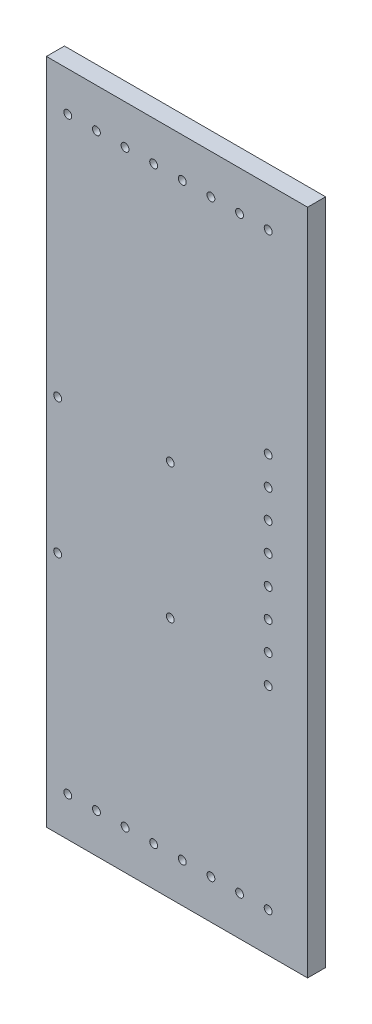
ISO-10303-21;
HEADER;
FILE_DESCRIPTION(('STEP AP214'),'2;1');
FILE_NAME('part.step','',(''),(''),'','','');
FILE_SCHEMA(('AUTOMOTIVE_DESIGN { 1 0 10303 214 1 1 1 1 }'));
ENDSEC;
DATA;
#1=APPLICATION_CONTEXT('core data for automotive mechanical design processes');
#2=APPLICATION_PROTOCOL_DEFINITION('international standard','automotive_design',2000,#1);
#3=PRODUCT_CONTEXT('',#1,'mechanical');
#4=PRODUCT('Part','Part','',(#3));
#5=PRODUCT_RELATED_PRODUCT_CATEGORY('part','',(#4));
#6=PRODUCT_DEFINITION_FORMATION('','',#4);
#7=PRODUCT_DEFINITION_CONTEXT('part definition',#1,'design');
#8=PRODUCT_DEFINITION('design','',#6,#7);
#9=PRODUCT_DEFINITION_SHAPE('','',#8);
#10=(LENGTH_UNIT() NAMED_UNIT(*) SI_UNIT(.MILLI.,.METRE.));
#11=(NAMED_UNIT(*) PLANE_ANGLE_UNIT() SI_UNIT($,.RADIAN.));
#12=(NAMED_UNIT(*) SI_UNIT($,.STERADIAN.) SOLID_ANGLE_UNIT());
#13=UNCERTAINTY_MEASURE_WITH_UNIT(LENGTH_MEASURE(1.E-05),#10,'distance_accuracy_value','');
#14=(GEOMETRIC_REPRESENTATION_CONTEXT(3) GLOBAL_UNCERTAINTY_ASSIGNED_CONTEXT((#13)) GLOBAL_UNIT_ASSIGNED_CONTEXT((#10,
#11,#12)) REPRESENTATION_CONTEXT('',''));
#15=CARTESIAN_POINT('',(0.,0.,0.));
#16=DIRECTION('',(0.,0.,1.));
#17=DIRECTION('',(1.,0.,0.));
#18=AXIS2_PLACEMENT_3D('',#15,#16,#17);
#19=CARTESIAN_POINT('',(40.5,-44.5,-92.));
#20=DIRECTION('',(0.,0.,1.));
#21=DIRECTION('',(1.,0.,0.));
#22=AXIS2_PLACEMENT_3D('',#19,#20,#21);
#23=CYLINDRICAL_SURFACE('',#22,1.75);
#24=CARTESIAN_POINT('',(40.5,-44.5,8.));
#25=DIRECTION('',(0.,0.,1.));
#26=DIRECTION('',(1.,0.,0.));
#27=AXIS2_PLACEMENT_3D('',#24,#25,#26);
#28=CIRCLE('',#27,1.75);
#29=CARTESIAN_POINT('',(42.25,-44.5,8.));
#30=VERTEX_POINT('',#29);
#31=EDGE_CURVE('E48',#30,#30,#28,.T.);
#32=ORIENTED_EDGE('',*,*,#31,.T.);
#33=EDGE_LOOP('',(#32));
#34=FACE_BOUND('',#33,.T.);
#35=CARTESIAN_POINT('',(40.5,-44.5,0.));
#36=DIRECTION('',(0.,0.,1.));
#37=DIRECTION('',(1.,0.,0.));
#38=AXIS2_PLACEMENT_3D('',#35,#36,#37);
#39=CIRCLE('',#38,1.75);
#40=CARTESIAN_POINT('',(42.25,-44.5,0.));
#41=VERTEX_POINT('',#40);
#42=EDGE_CURVE('E11',#41,#41,#39,.T.);
#43=ORIENTED_EDGE('',*,*,#42,.F.);
#44=EDGE_LOOP('',(#43));
#45=FACE_BOUND('',#44,.T.);
#46=ADVANCED_FACE('F39',(#34,#45),#23,.F.);
#47=CARTESIAN_POINT('',(40.5,-31.7857142857143,-92.));
#48=DIRECTION('',(0.,0.,1.));
#49=DIRECTION('',(1.,0.,0.));
#50=AXIS2_PLACEMENT_3D('',#47,#48,#49);
#51=CYLINDRICAL_SURFACE('',#50,1.75);
#52=CARTESIAN_POINT('',(40.5,-31.7857142857143,8.));
#53=DIRECTION('',(0.,0.,1.));
#54=DIRECTION('',(1.,0.,0.));
#55=AXIS2_PLACEMENT_3D('',#52,#53,#54);
#56=CIRCLE('',#55,1.75);
#57=CARTESIAN_POINT('',(42.25,-31.7857142857143,8.));
#58=VERTEX_POINT('',#57);
#59=EDGE_CURVE('E285',#58,#58,#56,.T.);
#60=ORIENTED_EDGE('',*,*,#59,.T.);
#61=EDGE_LOOP('',(#60));
#62=FACE_BOUND('',#61,.T.);
#63=CARTESIAN_POINT('',(40.5,-31.7857142857143,0.));
#64=DIRECTION('',(0.,0.,1.));
#65=DIRECTION('',(1.,0.,0.));
#66=AXIS2_PLACEMENT_3D('',#63,#64,#65);
#67=CIRCLE('',#66,1.75);
#68=CARTESIAN_POINT('',(42.25,-31.7857142857143,0.));
#69=VERTEX_POINT('',#68);
#70=EDGE_CURVE('E289',#69,#69,#67,.T.);
#71=ORIENTED_EDGE('',*,*,#70,.F.);
#72=EDGE_LOOP('',(#71));
#73=FACE_BOUND('',#72,.T.);
#74=ADVANCED_FACE('F315',(#62,#73),#51,.F.);
#75=CARTESIAN_POINT('',(40.5,-19.0714285714286,-92.));
#76=DIRECTION('',(0.,0.,1.));
#77=DIRECTION('',(1.,0.,0.));
#78=AXIS2_PLACEMENT_3D('',#75,#76,#77);
#79=CYLINDRICAL_SURFACE('',#78,1.75);
#80=CARTESIAN_POINT('',(40.5,-19.0714285714286,8.));
#81=DIRECTION('',(0.,0.,1.));
#82=DIRECTION('',(1.,0.,0.));
#83=AXIS2_PLACEMENT_3D('',#80,#81,#82);
#84=CIRCLE('',#83,1.75);
#85=CARTESIAN_POINT('',(42.25,-19.0714285714286,8.));
#86=VERTEX_POINT('',#85);
#87=EDGE_CURVE('E277',#86,#86,#84,.T.);
#88=ORIENTED_EDGE('',*,*,#87,.T.);
#89=EDGE_LOOP('',(#88));
#90=FACE_BOUND('',#89,.T.);
#91=CARTESIAN_POINT('',(40.5,-19.0714285714286,0.));
#92=DIRECTION('',(0.,0.,1.));
#93=DIRECTION('',(1.,0.,0.));
#94=AXIS2_PLACEMENT_3D('',#91,#92,#93);
#95=CIRCLE('',#94,1.75);
#96=CARTESIAN_POINT('',(42.25,-19.0714285714286,0.));
#97=VERTEX_POINT('',#96);
#98=EDGE_CURVE('E281',#97,#97,#95,.T.);
#99=ORIENTED_EDGE('',*,*,#98,.F.);
#100=EDGE_LOOP('',(#99));
#101=FACE_BOUND('',#100,.T.);
#102=ADVANCED_FACE('F319',(#90,#101),#79,.F.);
#103=CARTESIAN_POINT('',(40.5,-6.35714285714285,-92.));
#104=DIRECTION('',(0.,0.,1.));
#105=DIRECTION('',(1.,0.,0.));
#106=AXIS2_PLACEMENT_3D('',#103,#104,#105);
#107=CYLINDRICAL_SURFACE('',#106,1.75);
#108=CARTESIAN_POINT('',(40.5,-6.35714285714285,8.));
#109=DIRECTION('',(0.,0.,1.));
#110=DIRECTION('',(1.,0.,0.));
#111=AXIS2_PLACEMENT_3D('',#108,#109,#110);
#112=CIRCLE('',#111,1.75);
#113=CARTESIAN_POINT('',(42.25,-6.35714285714285,8.));
#114=VERTEX_POINT('',#113);
#115=EDGE_CURVE('E269',#114,#114,#112,.T.);
#116=ORIENTED_EDGE('',*,*,#115,.T.);
#117=EDGE_LOOP('',(#116));
#118=FACE_BOUND('',#117,.T.);
#119=CARTESIAN_POINT('',(40.5,-6.35714285714285,0.));
#120=DIRECTION('',(0.,0.,1.));
#121=DIRECTION('',(1.,0.,0.));
#122=AXIS2_PLACEMENT_3D('',#119,#120,#121);
#123=CIRCLE('',#122,1.75);
#124=CARTESIAN_POINT('',(42.25,-6.35714285714285,0.));
#125=VERTEX_POINT('',#124);
#126=EDGE_CURVE('E273',#125,#125,#123,.T.);
#127=ORIENTED_EDGE('',*,*,#126,.F.);
#128=EDGE_LOOP('',(#127));
#129=FACE_BOUND('',#128,.T.);
#130=ADVANCED_FACE('F324',(#118,#129),#107,.F.);
#131=CARTESIAN_POINT('',(40.5,6.35714285714287,-92.));
#132=DIRECTION('',(0.,0.,1.));
#133=DIRECTION('',(1.,0.,0.));
#134=AXIS2_PLACEMENT_3D('',#131,#132,#133);
#135=CYLINDRICAL_SURFACE('',#134,1.75);
#136=CARTESIAN_POINT('',(40.5,6.35714285714287,8.));
#137=DIRECTION('',(0.,0.,1.));
#138=DIRECTION('',(1.,0.,0.));
#139=AXIS2_PLACEMENT_3D('',#136,#137,#138);
#140=CIRCLE('',#139,1.75);
#141=CARTESIAN_POINT('',(42.25,6.35714285714287,8.));
#142=VERTEX_POINT('',#141);
#143=EDGE_CURVE('E261',#142,#142,#140,.T.);
#144=ORIENTED_EDGE('',*,*,#143,.T.);
#145=EDGE_LOOP('',(#144));
#146=FACE_BOUND('',#145,.T.);
#147=CARTESIAN_POINT('',(40.5,6.35714285714287,0.));
#148=DIRECTION('',(0.,0.,1.));
#149=DIRECTION('',(1.,0.,0.));
#150=AXIS2_PLACEMENT_3D('',#147,#148,#149);
#151=CIRCLE('',#150,1.75);
#152=CARTESIAN_POINT('',(42.25,6.35714285714287,0.));
#153=VERTEX_POINT('',#152);
#154=EDGE_CURVE('E265',#153,#153,#151,.T.);
#155=ORIENTED_EDGE('',*,*,#154,.F.);
#156=EDGE_LOOP('',(#155));
#157=FACE_BOUND('',#156,.T.);
#158=ADVANCED_FACE('F331',(#146,#157),#135,.F.);
#159=CARTESIAN_POINT('',(40.5,19.0714285714286,-92.));
#160=DIRECTION('',(0.,0.,1.));
#161=DIRECTION('',(1.,0.,0.));
#162=AXIS2_PLACEMENT_3D('',#159,#160,#161);
#163=CYLINDRICAL_SURFACE('',#162,1.75);
#164=CARTESIAN_POINT('',(40.5,19.0714285714286,8.));
#165=DIRECTION('',(0.,0.,1.));
#166=DIRECTION('',(1.,0.,0.));
#167=AXIS2_PLACEMENT_3D('',#164,#165,#166);
#168=CIRCLE('',#167,1.75);
#169=CARTESIAN_POINT('',(42.25,19.0714285714286,8.));
#170=VERTEX_POINT('',#169);
#171=EDGE_CURVE('E247',#170,#170,#168,.T.);
#172=ORIENTED_EDGE('',*,*,#171,.T.);
#173=EDGE_LOOP('',(#172));
#174=FACE_BOUND('',#173,.T.);
#175=CARTESIAN_POINT('',(40.5,19.0714285714286,0.));
#176=DIRECTION('',(0.,0.,1.));
#177=DIRECTION('',(1.,0.,0.));
#178=AXIS2_PLACEMENT_3D('',#175,#176,#177);
#179=CIRCLE('',#178,1.75);
#180=CARTESIAN_POINT('',(42.25,19.0714285714286,0.));
#181=VERTEX_POINT('',#180);
#182=EDGE_CURVE('E257',#181,#181,#179,.T.);
#183=ORIENTED_EDGE('',*,*,#182,.F.);
#184=EDGE_LOOP('',(#183));
#185=FACE_BOUND('',#184,.T.);
#186=ADVANCED_FACE('F335',(#174,#185),#163,.F.);
#187=CARTESIAN_POINT('',(40.5,-130.75,-92.));
#188=DIRECTION('',(0.,0.,1.));
#189=DIRECTION('',(1.,0.,0.));
#190=AXIS2_PLACEMENT_3D('',#187,#188,#189);
#191=CYLINDRICAL_SURFACE('',#190,1.75);
#192=CARTESIAN_POINT('',(40.5,-130.75,8.));
#193=DIRECTION('',(0.,0.,1.));
#194=DIRECTION('',(1.,0.,0.));
#195=AXIS2_PLACEMENT_3D('',#192,#193,#194);
#196=CIRCLE('',#195,1.75);
#197=CARTESIAN_POINT('',(42.25,-130.75,8.));
#198=VERTEX_POINT('',#197);
#199=EDGE_CURVE('E239',#198,#198,#196,.T.);
#200=ORIENTED_EDGE('',*,*,#199,.T.);
#201=EDGE_LOOP('',(#200));
#202=FACE_BOUND('',#201,.T.);
#203=CARTESIAN_POINT('',(40.5,-130.75,0.));
#204=DIRECTION('',(0.,0.,1.));
#205=DIRECTION('',(1.,0.,0.));
#206=AXIS2_PLACEMENT_3D('',#203,#204,#205);
#207=CIRCLE('',#206,1.75);
#208=CARTESIAN_POINT('',(42.25,-130.75,0.));
#209=VERTEX_POINT('',#208);
#210=EDGE_CURVE('E243',#209,#209,#207,.T.);
#211=ORIENTED_EDGE('',*,*,#210,.F.);
#212=EDGE_LOOP('',(#211));
#213=FACE_BOUND('',#212,.T.);
#214=ADVANCED_FACE('F339',(#202,#213),#191,.F.);
#215=CARTESIAN_POINT('',(27.7857142857143,-130.75,-92.));
#216=DIRECTION('',(0.,0.,1.));
#217=DIRECTION('',(1.,0.,0.));
#218=AXIS2_PLACEMENT_3D('',#215,#216,#217);
#219=CYLINDRICAL_SURFACE('',#218,1.75);
#220=CARTESIAN_POINT('',(27.7857142857143,-130.75,8.));
#221=DIRECTION('',(0.,0.,1.));
#222=DIRECTION('',(1.,0.,0.));
#223=AXIS2_PLACEMENT_3D('',#220,#221,#222);
#224=CIRCLE('',#223,1.75);
#225=CARTESIAN_POINT('',(29.5357142857143,-130.75,8.));
#226=VERTEX_POINT('',#225);
#227=EDGE_CURVE('E231',#226,#226,#224,.T.);
#228=ORIENTED_EDGE('',*,*,#227,.T.);
#229=EDGE_LOOP('',(#228));
#230=FACE_BOUND('',#229,.T.);
#231=CARTESIAN_POINT('',(27.7857142857143,-130.75,0.));
#232=DIRECTION('',(0.,0.,1.));
#233=DIRECTION('',(1.,0.,0.));
#234=AXIS2_PLACEMENT_3D('',#231,#232,#233);
#235=CIRCLE('',#234,1.75);
#236=CARTESIAN_POINT('',(29.5357142857143,-130.75,0.));
#237=VERTEX_POINT('',#236);
#238=EDGE_CURVE('E235',#237,#237,#235,.T.);
#239=ORIENTED_EDGE('',*,*,#238,.F.);
#240=EDGE_LOOP('',(#239));
#241=FACE_BOUND('',#240,.T.);
#242=ADVANCED_FACE('F343',(#230,#241),#219,.F.);
#243=CARTESIAN_POINT('',(15.0714285714285,-130.75,-92.));
#244=DIRECTION('',(0.,0.,1.));
#245=DIRECTION('',(1.,0.,0.));
#246=AXIS2_PLACEMENT_3D('',#243,#244,#245);
#247=CYLINDRICAL_SURFACE('',#246,1.75);
#248=CARTESIAN_POINT('',(15.0714285714285,-130.75,8.));
#249=DIRECTION('',(0.,0.,1.));
#250=DIRECTION('',(1.,0.,0.));
#251=AXIS2_PLACEMENT_3D('',#248,#249,#250);
#252=CIRCLE('',#251,1.75);
#253=CARTESIAN_POINT('',(16.8214285714285,-130.75,8.));
#254=VERTEX_POINT('',#253);
#255=EDGE_CURVE('E223',#254,#254,#252,.T.);
#256=ORIENTED_EDGE('',*,*,#255,.T.);
#257=EDGE_LOOP('',(#256));
#258=FACE_BOUND('',#257,.T.);
#259=CARTESIAN_POINT('',(15.0714285714285,-130.75,0.));
#260=DIRECTION('',(0.,0.,1.));
#261=DIRECTION('',(1.,0.,0.));
#262=AXIS2_PLACEMENT_3D('',#259,#260,#261);
#263=CIRCLE('',#262,1.75);
#264=CARTESIAN_POINT('',(16.8214285714285,-130.75,0.));
#265=VERTEX_POINT('',#264);
#266=EDGE_CURVE('E227',#265,#265,#263,.T.);
#267=ORIENTED_EDGE('',*,*,#266,.F.);
#268=EDGE_LOOP('',(#267));
#269=FACE_BOUND('',#268,.T.);
#270=ADVANCED_FACE('F347',(#258,#269),#247,.F.);
#271=CARTESIAN_POINT('',(2.35714285714283,-130.75,-92.));
#272=DIRECTION('',(0.,0.,1.));
#273=DIRECTION('',(1.,0.,0.));
#274=AXIS2_PLACEMENT_3D('',#271,#272,#273);
#275=CYLINDRICAL_SURFACE('',#274,1.75);
#276=CARTESIAN_POINT('',(2.35714285714283,-130.75,8.));
#277=DIRECTION('',(0.,0.,1.));
#278=DIRECTION('',(1.,0.,0.));
#279=AXIS2_PLACEMENT_3D('',#276,#277,#278);
#280=CIRCLE('',#279,1.75);
#281=CARTESIAN_POINT('',(4.10714285714283,-130.75,8.));
#282=VERTEX_POINT('',#281);
#283=EDGE_CURVE('E215',#282,#282,#280,.T.);
#284=ORIENTED_EDGE('',*,*,#283,.T.);
#285=EDGE_LOOP('',(#284));
#286=FACE_BOUND('',#285,.T.);
#287=CARTESIAN_POINT('',(2.35714285714283,-130.75,0.));
#288=DIRECTION('',(0.,0.,1.));
#289=DIRECTION('',(1.,0.,0.));
#290=AXIS2_PLACEMENT_3D('',#287,#288,#289);
#291=CIRCLE('',#290,1.75);
#292=CARTESIAN_POINT('',(4.10714285714283,-130.75,0.));
#293=VERTEX_POINT('',#292);
#294=EDGE_CURVE('E219',#293,#293,#291,.T.);
#295=ORIENTED_EDGE('',*,*,#294,.F.);
#296=EDGE_LOOP('',(#295));
#297=FACE_BOUND('',#296,.T.);
#298=ADVANCED_FACE('F351',(#286,#297),#275,.F.);
#299=CARTESIAN_POINT('',(-10.3571428571429,-130.75,-92.));
#300=DIRECTION('',(0.,0.,1.));
#301=DIRECTION('',(1.,0.,0.));
#302=AXIS2_PLACEMENT_3D('',#299,#300,#301);
#303=CYLINDRICAL_SURFACE('',#302,1.75);
#304=CARTESIAN_POINT('',(-10.3571428571429,-130.75,8.));
#305=DIRECTION('',(0.,0.,1.));
#306=DIRECTION('',(1.,0.,0.));
#307=AXIS2_PLACEMENT_3D('',#304,#305,#306);
#308=CIRCLE('',#307,1.75);
#309=CARTESIAN_POINT('',(-8.60714285714288,-130.75,8.));
#310=VERTEX_POINT('',#309);
#311=EDGE_CURVE('E207',#310,#310,#308,.T.);
#312=ORIENTED_EDGE('',*,*,#311,.T.);
#313=EDGE_LOOP('',(#312));
#314=FACE_BOUND('',#313,.T.);
#315=CARTESIAN_POINT('',(-10.3571428571429,-130.75,0.));
#316=DIRECTION('',(0.,0.,1.));
#317=DIRECTION('',(1.,0.,0.));
#318=AXIS2_PLACEMENT_3D('',#315,#316,#317);
#319=CIRCLE('',#318,1.75);
#320=CARTESIAN_POINT('',(-8.60714285714288,-130.75,0.));
#321=VERTEX_POINT('',#320);
#322=EDGE_CURVE('E211',#321,#321,#319,.T.);
#323=ORIENTED_EDGE('',*,*,#322,.F.);
#324=EDGE_LOOP('',(#323));
#325=FACE_BOUND('',#324,.T.);
#326=ADVANCED_FACE('F355',(#314,#325),#303,.F.);
#327=CARTESIAN_POINT('',(-23.0714285714286,-130.75,-92.));
#328=DIRECTION('',(0.,0.,1.));
#329=DIRECTION('',(1.,0.,0.));
#330=AXIS2_PLACEMENT_3D('',#327,#328,#329);
#331=CYLINDRICAL_SURFACE('',#330,1.75);
#332=CARTESIAN_POINT('',(-23.0714285714286,-130.75,8.));
#333=DIRECTION('',(0.,0.,1.));
#334=DIRECTION('',(1.,0.,0.));
#335=AXIS2_PLACEMENT_3D('',#332,#333,#334);
#336=CIRCLE('',#335,1.75);
#337=CARTESIAN_POINT('',(-21.3214285714286,-130.75,8.));
#338=VERTEX_POINT('',#337);
#339=EDGE_CURVE('E199',#338,#338,#336,.T.);
#340=ORIENTED_EDGE('',*,*,#339,.T.);
#341=EDGE_LOOP('',(#340));
#342=FACE_BOUND('',#341,.T.);
#343=CARTESIAN_POINT('',(-23.0714285714286,-130.75,0.));
#344=DIRECTION('',(0.,0.,1.));
#345=DIRECTION('',(1.,0.,0.));
#346=AXIS2_PLACEMENT_3D('',#343,#344,#345);
#347=CIRCLE('',#346,1.75);
#348=CARTESIAN_POINT('',(-21.3214285714286,-130.75,0.));
#349=VERTEX_POINT('',#348);
#350=EDGE_CURVE('E203',#349,#349,#347,.T.);
#351=ORIENTED_EDGE('',*,*,#350,.F.);
#352=EDGE_LOOP('',(#351));
#353=FACE_BOUND('',#352,.T.);
#354=ADVANCED_FACE('F359',(#342,#353),#331,.F.);
#355=CARTESIAN_POINT('',(-35.7857142857143,-130.75,-92.));
#356=DIRECTION('',(0.,0.,1.));
#357=DIRECTION('',(1.,0.,0.));
#358=AXIS2_PLACEMENT_3D('',#355,#356,#357);
#359=CYLINDRICAL_SURFACE('',#358,1.75);
#360=CARTESIAN_POINT('',(-35.7857142857143,-130.75,8.));
#361=DIRECTION('',(0.,0.,1.));
#362=DIRECTION('',(1.,0.,0.));
#363=AXIS2_PLACEMENT_3D('',#360,#361,#362);
#364=CIRCLE('',#363,1.75);
#365=CARTESIAN_POINT('',(-34.0357142857143,-130.75,8.));
#366=VERTEX_POINT('',#365);
#367=EDGE_CURVE('E191',#366,#366,#364,.T.);
#368=ORIENTED_EDGE('',*,*,#367,.T.);
#369=EDGE_LOOP('',(#368));
#370=FACE_BOUND('',#369,.T.);
#371=CARTESIAN_POINT('',(-35.7857142857143,-130.75,0.));
#372=DIRECTION('',(0.,0.,1.));
#373=DIRECTION('',(1.,0.,0.));
#374=AXIS2_PLACEMENT_3D('',#371,#372,#373);
#375=CIRCLE('',#374,1.75);
#376=CARTESIAN_POINT('',(-34.0357142857143,-130.75,0.));
#377=VERTEX_POINT('',#376);
#378=EDGE_CURVE('E195',#377,#377,#375,.T.);
#379=ORIENTED_EDGE('',*,*,#378,.F.);
#380=EDGE_LOOP('',(#379));
#381=FACE_BOUND('',#380,.T.);
#382=ADVANCED_FACE('F363',(#370,#381),#359,.F.);
#383=CARTESIAN_POINT('',(-48.5,-130.75,-92.));
#384=DIRECTION('',(0.,0.,1.));
#385=DIRECTION('',(1.,0.,0.));
#386=AXIS2_PLACEMENT_3D('',#383,#384,#385);
#387=CYLINDRICAL_SURFACE('',#386,1.75);
#388=CARTESIAN_POINT('',(-48.5,-130.75,8.));
#389=DIRECTION('',(0.,0.,1.));
#390=DIRECTION('',(1.,0.,0.));
#391=AXIS2_PLACEMENT_3D('',#388,#389,#390);
#392=CIRCLE('',#391,1.75);
#393=CARTESIAN_POINT('',(-46.75,-130.75,8.));
#394=VERTEX_POINT('',#393);
#395=EDGE_CURVE('E183',#394,#394,#392,.T.);
#396=ORIENTED_EDGE('',*,*,#395,.T.);
#397=EDGE_LOOP('',(#396));
#398=FACE_BOUND('',#397,.T.);
#399=CARTESIAN_POINT('',(-48.5,-130.75,0.));
#400=DIRECTION('',(0.,0.,1.));
#401=DIRECTION('',(1.,0.,0.));
#402=AXIS2_PLACEMENT_3D('',#399,#400,#401);
#403=CIRCLE('',#402,1.75);
#404=CARTESIAN_POINT('',(-46.75,-130.75,0.));
#405=VERTEX_POINT('',#404);
#406=EDGE_CURVE('E187',#405,#405,#403,.T.);
#407=ORIENTED_EDGE('',*,*,#406,.F.);
#408=EDGE_LOOP('',(#407));
#409=FACE_BOUND('',#408,.T.);
#410=ADVANCED_FACE('F367',(#398,#409),#387,.F.);
#411=CARTESIAN_POINT('',(40.4999999999999,130.75,-92.));
#412=DIRECTION('',(0.,0.,1.));
#413=DIRECTION('',(1.,0.,0.));
#414=AXIS2_PLACEMENT_3D('',#411,#412,#413);
#415=CYLINDRICAL_SURFACE('',#414,1.75);
#416=CARTESIAN_POINT('',(40.4999999999999,130.75,8.));
#417=DIRECTION('',(0.,0.,1.));
#418=DIRECTION('',(1.,0.,0.));
#419=AXIS2_PLACEMENT_3D('',#416,#417,#418);
#420=CIRCLE('',#419,1.75);
#421=CARTESIAN_POINT('',(42.2499999999999,130.75,8.));
#422=VERTEX_POINT('',#421);
#423=EDGE_CURVE('E175',#422,#422,#420,.T.);
#424=ORIENTED_EDGE('',*,*,#423,.T.);
#425=EDGE_LOOP('',(#424));
#426=FACE_BOUND('',#425,.T.);
#427=CARTESIAN_POINT('',(40.4999999999999,130.75,0.));
#428=DIRECTION('',(0.,0.,1.));
#429=DIRECTION('',(1.,0.,0.));
#430=AXIS2_PLACEMENT_3D('',#427,#428,#429);
#431=CIRCLE('',#430,1.75);
#432=CARTESIAN_POINT('',(42.2499999999999,130.75,0.));
#433=VERTEX_POINT('',#432);
#434=EDGE_CURVE('E179',#433,#433,#431,.T.);
#435=ORIENTED_EDGE('',*,*,#434,.F.);
#436=EDGE_LOOP('',(#435));
#437=FACE_BOUND('',#436,.T.);
#438=ADVANCED_FACE('F371',(#426,#437),#415,.F.);
#439=CARTESIAN_POINT('',(27.7857142857142,130.75,-92.));
#440=DIRECTION('',(0.,0.,1.));
#441=DIRECTION('',(1.,0.,0.));
#442=AXIS2_PLACEMENT_3D('',#439,#440,#441);
#443=CYLINDRICAL_SURFACE('',#442,1.75);
#444=CARTESIAN_POINT('',(27.7857142857142,130.75,8.));
#445=DIRECTION('',(0.,0.,1.));
#446=DIRECTION('',(1.,0.,0.));
#447=AXIS2_PLACEMENT_3D('',#444,#445,#446);
#448=CIRCLE('',#447,1.75);
#449=CARTESIAN_POINT('',(29.5357142857142,130.75,8.));
#450=VERTEX_POINT('',#449);
#451=EDGE_CURVE('E167',#450,#450,#448,.T.);
#452=ORIENTED_EDGE('',*,*,#451,.T.);
#453=EDGE_LOOP('',(#452));
#454=FACE_BOUND('',#453,.T.);
#455=CARTESIAN_POINT('',(27.7857142857142,130.75,0.));
#456=DIRECTION('',(0.,0.,1.));
#457=DIRECTION('',(1.,0.,0.));
#458=AXIS2_PLACEMENT_3D('',#455,#456,#457);
#459=CIRCLE('',#458,1.75);
#460=CARTESIAN_POINT('',(29.5357142857142,130.75,0.));
#461=VERTEX_POINT('',#460);
#462=EDGE_CURVE('E171',#461,#461,#459,.T.);
#463=ORIENTED_EDGE('',*,*,#462,.F.);
#464=EDGE_LOOP('',(#463));
#465=FACE_BOUND('',#464,.T.);
#466=ADVANCED_FACE('F375',(#454,#465),#443,.F.);
#467=CARTESIAN_POINT('',(15.0714285714285,130.75,-92.));
#468=DIRECTION('',(0.,0.,1.));
#469=DIRECTION('',(1.,0.,0.));
#470=AXIS2_PLACEMENT_3D('',#467,#468,#469);
#471=CYLINDRICAL_SURFACE('',#470,1.75);
#472=CARTESIAN_POINT('',(15.0714285714285,130.75,8.));
#473=DIRECTION('',(0.,0.,1.));
#474=DIRECTION('',(1.,0.,0.));
#475=AXIS2_PLACEMENT_3D('',#472,#473,#474);
#476=CIRCLE('',#475,1.75);
#477=CARTESIAN_POINT('',(16.8214285714285,130.75,8.));
#478=VERTEX_POINT('',#477);
#479=EDGE_CURVE('E159',#478,#478,#476,.T.);
#480=ORIENTED_EDGE('',*,*,#479,.T.);
#481=EDGE_LOOP('',(#480));
#482=FACE_BOUND('',#481,.T.);
#483=CARTESIAN_POINT('',(15.0714285714285,130.75,0.));
#484=DIRECTION('',(0.,0.,1.));
#485=DIRECTION('',(1.,0.,0.));
#486=AXIS2_PLACEMENT_3D('',#483,#484,#485);
#487=CIRCLE('',#486,1.75);
#488=CARTESIAN_POINT('',(16.8214285714285,130.75,0.));
#489=VERTEX_POINT('',#488);
#490=EDGE_CURVE('E163',#489,#489,#487,.T.);
#491=ORIENTED_EDGE('',*,*,#490,.F.);
#492=EDGE_LOOP('',(#491));
#493=FACE_BOUND('',#492,.T.);
#494=ADVANCED_FACE('F379',(#482,#493),#471,.F.);
#495=CARTESIAN_POINT('',(2.3571428571428,130.75,-92.));
#496=DIRECTION('',(0.,0.,1.));
#497=DIRECTION('',(1.,0.,0.));
#498=AXIS2_PLACEMENT_3D('',#495,#496,#497);
#499=CYLINDRICAL_SURFACE('',#498,1.75);
#500=CARTESIAN_POINT('',(2.3571428571428,130.75,8.));
#501=DIRECTION('',(0.,0.,1.));
#502=DIRECTION('',(1.,0.,0.));
#503=AXIS2_PLACEMENT_3D('',#500,#501,#502);
#504=CIRCLE('',#503,1.75);
#505=CARTESIAN_POINT('',(4.10714285714281,130.75,8.));
#506=VERTEX_POINT('',#505);
#507=EDGE_CURVE('E151',#506,#506,#504,.T.);
#508=ORIENTED_EDGE('',*,*,#507,.T.);
#509=EDGE_LOOP('',(#508));
#510=FACE_BOUND('',#509,.T.);
#511=CARTESIAN_POINT('',(2.3571428571428,130.75,0.));
#512=DIRECTION('',(0.,0.,1.));
#513=DIRECTION('',(1.,0.,0.));
#514=AXIS2_PLACEMENT_3D('',#511,#512,#513);
#515=CIRCLE('',#514,1.75);
#516=CARTESIAN_POINT('',(4.10714285714281,130.75,0.));
#517=VERTEX_POINT('',#516);
#518=EDGE_CURVE('E155',#517,#517,#515,.T.);
#519=ORIENTED_EDGE('',*,*,#518,.F.);
#520=EDGE_LOOP('',(#519));
#521=FACE_BOUND('',#520,.T.);
#522=ADVANCED_FACE('F383',(#510,#521),#499,.F.);
#523=CARTESIAN_POINT('',(-10.3571428571429,130.75,-92.));
#524=DIRECTION('',(0.,0.,1.));
#525=DIRECTION('',(1.,0.,0.));
#526=AXIS2_PLACEMENT_3D('',#523,#524,#525);
#527=CYLINDRICAL_SURFACE('',#526,1.75);
#528=CARTESIAN_POINT('',(-10.3571428571429,130.75,8.));
#529=DIRECTION('',(0.,0.,1.));
#530=DIRECTION('',(1.,0.,0.));
#531=AXIS2_PLACEMENT_3D('',#528,#529,#530);
#532=CIRCLE('',#531,1.75);
#533=CARTESIAN_POINT('',(-8.60714285714291,130.75,8.));
#534=VERTEX_POINT('',#533);
#535=EDGE_CURVE('E143',#534,#534,#532,.T.);
#536=ORIENTED_EDGE('',*,*,#535,.T.);
#537=EDGE_LOOP('',(#536));
#538=FACE_BOUND('',#537,.T.);
#539=CARTESIAN_POINT('',(-10.3571428571429,130.75,0.));
#540=DIRECTION('',(0.,0.,1.));
#541=DIRECTION('',(1.,0.,0.));
#542=AXIS2_PLACEMENT_3D('',#539,#540,#541);
#543=CIRCLE('',#542,1.75);
#544=CARTESIAN_POINT('',(-8.60714285714291,130.75,0.));
#545=VERTEX_POINT('',#544);
#546=EDGE_CURVE('E147',#545,#545,#543,.T.);
#547=ORIENTED_EDGE('',*,*,#546,.F.);
#548=EDGE_LOOP('',(#547));
#549=FACE_BOUND('',#548,.T.);
#550=ADVANCED_FACE('F387',(#538,#549),#527,.F.);
#551=CARTESIAN_POINT('',(-23.0714285714286,130.75,-92.));
#552=DIRECTION('',(0.,0.,1.));
#553=DIRECTION('',(1.,0.,0.));
#554=AXIS2_PLACEMENT_3D('',#551,#552,#553);
#555=CYLINDRICAL_SURFACE('',#554,1.75);
#556=CARTESIAN_POINT('',(-23.0714285714286,130.75,8.));
#557=DIRECTION('',(0.,0.,1.));
#558=DIRECTION('',(1.,0.,0.));
#559=AXIS2_PLACEMENT_3D('',#556,#557,#558);
#560=CIRCLE('',#559,1.75);
#561=CARTESIAN_POINT('',(-21.3214285714286,130.75,8.));
#562=VERTEX_POINT('',#561);
#563=EDGE_CURVE('E129',#562,#562,#560,.T.);
#564=ORIENTED_EDGE('',*,*,#563,.T.);
#565=EDGE_LOOP('',(#564));
#566=FACE_BOUND('',#565,.T.);
#567=CARTESIAN_POINT('',(-23.0714285714286,130.75,0.));
#568=DIRECTION('',(0.,0.,1.));
#569=DIRECTION('',(1.,0.,0.));
#570=AXIS2_PLACEMENT_3D('',#567,#568,#569);
#571=CIRCLE('',#570,1.75);
#572=CARTESIAN_POINT('',(-21.3214285714286,130.75,0.));
#573=VERTEX_POINT('',#572);
#574=EDGE_CURVE('E139',#573,#573,#571,.T.);
#575=ORIENTED_EDGE('',*,*,#574,.F.);
#576=EDGE_LOOP('',(#575));
#577=FACE_BOUND('',#576,.T.);
#578=ADVANCED_FACE('F391',(#566,#577),#555,.F.);
#579=CARTESIAN_POINT('',(58.,148.25,8.));
#580=DIRECTION('',(-1.,0.,0.));
#581=DIRECTION('',(0.,-1.,0.));
#582=AXIS2_PLACEMENT_3D('',#579,#580,#581);
#583=PLANE('',#582);
#584=DIRECTION('',(0.,1.,0.));
#585=VECTOR('',#584,1.);
#586=CARTESIAN_POINT('',(58.,148.25,0.));
#587=LINE('',#586,#585);
#588=CARTESIAN_POINT('',(58.,-148.25,0.));
#589=VERTEX_POINT('',#588);
#590=CARTESIAN_POINT('',(58.,148.25,0.));
#591=VERTEX_POINT('',#590);
#592=EDGE_CURVE('E112',#589,#591,#587,.T.);
#593=ORIENTED_EDGE('',*,*,#592,.T.);
#594=DIRECTION('',(0.,0.,-1.));
#595=VECTOR('',#594,1.);
#596=CARTESIAN_POINT('',(58.,148.25,8.));
#597=LINE('',#596,#595);
#598=CARTESIAN_POINT('',(58.,148.25,8.));
#599=VERTEX_POINT('',#598);
#600=EDGE_CURVE('E101',#599,#591,#597,.T.);
#601=ORIENTED_EDGE('',*,*,#600,.F.);
#602=DIRECTION('',(0.,1.,0.));
#603=VECTOR('',#602,1.);
#604=CARTESIAN_POINT('',(58.,148.25,8.));
#605=LINE('',#604,#603);
#606=CARTESIAN_POINT('',(58.,-148.25,8.));
#607=VERTEX_POINT('',#606);
#608=EDGE_CURVE('E93',#607,#599,#605,.T.);
#609=ORIENTED_EDGE('',*,*,#608,.F.);
#610=DIRECTION('',(0.,0.,-1.));
#611=VECTOR('',#610,1.);
#612=CARTESIAN_POINT('',(58.,-148.25,8.));
#613=LINE('',#612,#611);
#614=EDGE_CURVE('E108',#607,#589,#613,.T.);
#615=ORIENTED_EDGE('',*,*,#614,.T.);
#616=EDGE_LOOP('',(#593,#601,#609,#615));
#617=FACE_BOUND('',#616,.T.);
#618=ADVANCED_FACE('F395',(#617),#583,.F.);
#619=CARTESIAN_POINT('',(-58.,148.25,8.));
#620=DIRECTION('',(0.,-1.,0.));
#621=DIRECTION('',(0.,0.,-1.));
#622=AXIS2_PLACEMENT_3D('',#619,#620,#621);
#623=PLANE('',#622);
#624=DIRECTION('',(-1.,0.,0.));
#625=VECTOR('',#624,1.);
#626=CARTESIAN_POINT('',(-58.,148.25,0.));
#627=LINE('',#626,#625);
#628=CARTESIAN_POINT('',(-58.,148.25,0.));
#629=VERTEX_POINT('',#628);
#630=EDGE_CURVE('E99',#591,#629,#627,.T.);
#631=ORIENTED_EDGE('',*,*,#630,.T.);
#632=DIRECTION('',(0.,0.,-1.));
#633=VECTOR('',#632,1.);
#634=CARTESIAN_POINT('',(-58.,148.25,8.));
#635=LINE('',#634,#633);
#636=CARTESIAN_POINT('',(-58.,148.25,8.));
#637=VERTEX_POINT('',#636);
#638=EDGE_CURVE('E97',#637,#629,#635,.T.);
#639=ORIENTED_EDGE('',*,*,#638,.F.);
#640=DIRECTION('',(-1.,0.,0.));
#641=VECTOR('',#640,1.);
#642=CARTESIAN_POINT('',(-58.,148.25,8.));
#643=LINE('',#642,#641);
#644=EDGE_CURVE('E87',#599,#637,#643,.T.);
#645=ORIENTED_EDGE('',*,*,#644,.F.);
#646=ORIENTED_EDGE('',*,*,#600,.T.);
#647=EDGE_LOOP('',(#631,#639,#645,#646));
#648=FACE_BOUND('',#647,.T.);
#649=ADVANCED_FACE('F98',(#648),#623,.F.);
#650=CARTESIAN_POINT('',(-58.,148.25,8.));
#651=DIRECTION('',(1.,0.,0.));
#652=DIRECTION('',(0.,1.,0.));
#653=AXIS2_PLACEMENT_3D('',#650,#651,#652);
#654=PLANE('',#653);
#655=DIRECTION('',(0.,-1.,0.));
#656=VECTOR('',#655,1.);
#657=CARTESIAN_POINT('',(-58.,148.25,0.));
#658=LINE('',#657,#656);
#659=CARTESIAN_POINT('',(-58.,-148.25,0.));
#660=VERTEX_POINT('',#659);
#661=EDGE_CURVE('E73',#629,#660,#658,.T.);
#662=ORIENTED_EDGE('',*,*,#661,.T.);
#663=DIRECTION('',(0.,0.,-1.));
#664=VECTOR('',#663,1.);
#665=CARTESIAN_POINT('',(-58.,-148.25,8.));
#666=LINE('',#665,#664);
#667=CARTESIAN_POINT('',(-58.,-148.25,8.));
#668=VERTEX_POINT('',#667);
#669=EDGE_CURVE('E102',#668,#660,#666,.T.);
#670=ORIENTED_EDGE('',*,*,#669,.F.);
#671=DIRECTION('',(0.,-1.,0.));
#672=VECTOR('',#671,1.);
#673=CARTESIAN_POINT('',(-58.,148.25,8.));
#674=LINE('',#673,#672);
#675=EDGE_CURVE('E91',#637,#668,#674,.T.);
#676=ORIENTED_EDGE('',*,*,#675,.F.);
#677=ORIENTED_EDGE('',*,*,#638,.T.);
#678=EDGE_LOOP('',(#662,#670,#676,#677));
#679=FACE_BOUND('',#678,.T.);
#680=ADVANCED_FACE('F104',(#679),#654,.F.);
#681=CARTESIAN_POINT('',(-58.,-148.25,8.));
#682=DIRECTION('',(0.,1.,0.));
#683=DIRECTION('',(0.,0.,1.));
#684=AXIS2_PLACEMENT_3D('',#681,#682,#683);
#685=PLANE('',#684);
#686=DIRECTION('',(1.,0.,0.));
#687=VECTOR('',#686,1.);
#688=CARTESIAN_POINT('',(-58.,-148.25,0.));
#689=LINE('',#688,#687);
#690=EDGE_CURVE('E79',#660,#589,#689,.T.);
#691=ORIENTED_EDGE('',*,*,#690,.T.);
#692=ORIENTED_EDGE('',*,*,#614,.F.);
#693=DIRECTION('',(1.,0.,0.));
#694=VECTOR('',#693,1.);
#695=CARTESIAN_POINT('',(-58.,-148.25,8.));
#696=LINE('',#695,#694);
#697=EDGE_CURVE('E56',#668,#607,#696,.T.);
#698=ORIENTED_EDGE('',*,*,#697,.F.);
#699=ORIENTED_EDGE('',*,*,#669,.T.);
#700=EDGE_LOOP('',(#691,#692,#698,#699));
#701=FACE_BOUND('',#700,.T.);
#702=ADVANCED_FACE('F300',(#701),#685,.F.);
#703=CARTESIAN_POINT('',(0.,0.,8.));
#704=DIRECTION('',(0.,0.,1.));
#705=DIRECTION('',(1.,0.,0.));
#706=AXIS2_PLACEMENT_3D('',#703,#704,#705);
#707=PLANE('',#706);
#708=CARTESIAN_POINT('',(40.5,31.7857142857143,8.));
#709=DIRECTION('',(0.,0.,1.));
#710=DIRECTION('',(1.,0.,0.));
#711=AXIS2_PLACEMENT_3D('',#708,#709,#710);
#712=CIRCLE('',#711,1.75);
#713=CARTESIAN_POINT('',(42.25,31.7857142857143,8.));
#714=VERTEX_POINT('',#713);
#715=EDGE_CURVE('E621',#714,#714,#712,.T.);
#716=ORIENTED_EDGE('',*,*,#715,.F.);
#717=EDGE_LOOP('',(#716));
#718=FACE_BOUND('',#717,.T.);
#719=CARTESIAN_POINT('',(40.5,44.5,8.));
#720=DIRECTION('',(0.,0.,1.));
#721=DIRECTION('',(1.,0.,0.));
#722=AXIS2_PLACEMENT_3D('',#719,#720,#721);
#723=CIRCLE('',#722,1.75);
#724=CARTESIAN_POINT('',(42.25,44.5,8.));
#725=VERTEX_POINT('',#724);
#726=EDGE_CURVE('E253',#725,#725,#723,.T.);
#727=ORIENTED_EDGE('',*,*,#726,.F.);
#728=EDGE_LOOP('',(#727));
#729=FACE_BOUND('',#728,.T.);
#730=CARTESIAN_POINT('',(-35.7857142857143,130.75,8.));
#731=DIRECTION('',(0.,0.,1.));
#732=DIRECTION('',(1.,0.,0.));
#733=AXIS2_PLACEMENT_3D('',#730,#731,#732);
#734=CIRCLE('',#733,1.75);
#735=CARTESIAN_POINT('',(-34.0357142857143,130.75,8.));
#736=VERTEX_POINT('',#735);
#737=EDGE_CURVE('E252',#736,#736,#734,.T.);
#738=ORIENTED_EDGE('',*,*,#737,.F.);
#739=EDGE_LOOP('',(#738));
#740=FACE_BOUND('',#739,.T.);
#741=CARTESIAN_POINT('',(-48.5000000000001,130.75,8.));
#742=DIRECTION('',(0.,0.,1.));
#743=DIRECTION('',(1.,0.,0.));
#744=AXIS2_PLACEMENT_3D('',#741,#742,#743);
#745=CIRCLE('',#744,1.75);
#746=CARTESIAN_POINT('',(-46.7500000000001,130.75,8.));
#747=VERTEX_POINT('',#746);
#748=EDGE_CURVE('E135',#747,#747,#745,.T.);
#749=ORIENTED_EDGE('',*,*,#748,.F.);
#750=EDGE_LOOP('',(#749));
#751=FACE_BOUND('',#750,.T.);
#752=CARTESIAN_POINT('',(-53.0000000000001,-40.2499999999999,8.));
#753=DIRECTION('',(0.,0.,-1.));
#754=DIRECTION('',(-1.,0.,0.));
#755=AXIS2_PLACEMENT_3D('',#752,#753,#754);
#756=CIRCLE('',#755,1.75);
#757=CARTESIAN_POINT('',(-54.7500000000001,-40.2499999999999,8.));
#758=VERTEX_POINT('',#757);
#759=EDGE_CURVE('E660',#758,#758,#756,.T.);
#760=ORIENTED_EDGE('',*,*,#759,.T.);
#761=EDGE_LOOP('',(#760));
#762=FACE_BOUND('',#761,.T.);
#763=CARTESIAN_POINT('',(-53.0000000000001,19.7500000000001,8.));
#764=DIRECTION('',(0.,0.,-1.));
#765=DIRECTION('',(-1.,0.,0.));
#766=AXIS2_PLACEMENT_3D('',#763,#764,#765);
#767=CIRCLE('',#766,1.75);
#768=CARTESIAN_POINT('',(-54.7500000000001,19.7500000000001,8.));
#769=VERTEX_POINT('',#768);
#770=EDGE_CURVE('E652',#769,#769,#767,.T.);
#771=ORIENTED_EDGE('',*,*,#770,.T.);
#772=EDGE_LOOP('',(#771));
#773=FACE_BOUND('',#772,.T.);
#774=CARTESIAN_POINT('',(-3.00000000000005,19.7500000000001,8.));
#775=DIRECTION('',(0.,0.,-1.));
#776=DIRECTION('',(-1.,0.,0.));
#777=AXIS2_PLACEMENT_3D('',#774,#775,#776);
#778=CIRCLE('',#777,1.75);
#779=CARTESIAN_POINT('',(-4.75000000000006,19.7500000000001,8.));
#780=VERTEX_POINT('',#779);
#781=EDGE_CURVE('E643',#780,#780,#778,.T.);
#782=ORIENTED_EDGE('',*,*,#781,.T.);
#783=EDGE_LOOP('',(#782));
#784=FACE_BOUND('',#783,.T.);
#785=CARTESIAN_POINT('',(-3.00000000000005,-40.2499999999999,8.));
#786=DIRECTION('',(0.,0.,-1.));
#787=DIRECTION('',(-1.,0.,0.));
#788=AXIS2_PLACEMENT_3D('',#785,#786,#787);
#789=CIRCLE('',#788,1.75);
#790=CARTESIAN_POINT('',(-4.75000000000006,-40.2499999999999,8.));
#791=VERTEX_POINT('',#790);
#792=EDGE_CURVE('E116',#791,#791,#789,.T.);
#793=ORIENTED_EDGE('',*,*,#792,.T.);
#794=EDGE_LOOP('',(#793));
#795=FACE_BOUND('',#794,.T.);
#796=ORIENTED_EDGE('',*,*,#608,.T.);
#797=ORIENTED_EDGE('',*,*,#644,.T.);
#798=ORIENTED_EDGE('',*,*,#675,.T.);
#799=ORIENTED_EDGE('',*,*,#697,.T.);
#800=EDGE_LOOP('',(#796,#797,#798,#799));
#801=FACE_BOUND('',#800,.T.);
#802=ORIENTED_EDGE('',*,*,#563,.F.);
#803=EDGE_LOOP('',(#802));
#804=FACE_BOUND('',#803,.T.);
#805=ORIENTED_EDGE('',*,*,#535,.F.);
#806=EDGE_LOOP('',(#805));
#807=FACE_BOUND('',#806,.T.);
#808=ORIENTED_EDGE('',*,*,#507,.F.);
#809=EDGE_LOOP('',(#808));
#810=FACE_BOUND('',#809,.T.);
#811=ORIENTED_EDGE('',*,*,#479,.F.);
#812=EDGE_LOOP('',(#811));
#813=FACE_BOUND('',#812,.T.);
#814=ORIENTED_EDGE('',*,*,#451,.F.);
#815=EDGE_LOOP('',(#814));
#816=FACE_BOUND('',#815,.T.);
#817=ORIENTED_EDGE('',*,*,#423,.F.);
#818=EDGE_LOOP('',(#817));
#819=FACE_BOUND('',#818,.T.);
#820=ORIENTED_EDGE('',*,*,#395,.F.);
#821=EDGE_LOOP('',(#820));
#822=FACE_BOUND('',#821,.T.);
#823=ORIENTED_EDGE('',*,*,#367,.F.);
#824=EDGE_LOOP('',(#823));
#825=FACE_BOUND('',#824,.T.);
#826=ORIENTED_EDGE('',*,*,#339,.F.);
#827=EDGE_LOOP('',(#826));
#828=FACE_BOUND('',#827,.T.);
#829=ORIENTED_EDGE('',*,*,#311,.F.);
#830=EDGE_LOOP('',(#829));
#831=FACE_BOUND('',#830,.T.);
#832=ORIENTED_EDGE('',*,*,#283,.F.);
#833=EDGE_LOOP('',(#832));
#834=FACE_BOUND('',#833,.T.);
#835=ORIENTED_EDGE('',*,*,#255,.F.);
#836=EDGE_LOOP('',(#835));
#837=FACE_BOUND('',#836,.T.);
#838=ORIENTED_EDGE('',*,*,#227,.F.);
#839=EDGE_LOOP('',(#838));
#840=FACE_BOUND('',#839,.T.);
#841=ORIENTED_EDGE('',*,*,#199,.F.);
#842=EDGE_LOOP('',(#841));
#843=FACE_BOUND('',#842,.T.);
#844=ORIENTED_EDGE('',*,*,#171,.F.);
#845=EDGE_LOOP('',(#844));
#846=FACE_BOUND('',#845,.T.);
#847=ORIENTED_EDGE('',*,*,#143,.F.);
#848=EDGE_LOOP('',(#847));
#849=FACE_BOUND('',#848,.T.);
#850=ORIENTED_EDGE('',*,*,#115,.F.);
#851=EDGE_LOOP('',(#850));
#852=FACE_BOUND('',#851,.T.);
#853=ORIENTED_EDGE('',*,*,#87,.F.);
#854=EDGE_LOOP('',(#853));
#855=FACE_BOUND('',#854,.T.);
#856=ORIENTED_EDGE('',*,*,#59,.F.);
#857=EDGE_LOOP('',(#856));
#858=FACE_BOUND('',#857,.T.);
#859=ORIENTED_EDGE('',*,*,#31,.F.);
#860=EDGE_LOOP('',(#859));
#861=FACE_BOUND('',#860,.T.);
#862=ADVANCED_FACE('F88',(#718,#729,#740,#751,#762,#773,#784,#795,#801,#804,#807,#810,#813,#816,
#819,#822,#825,#828,#831,#834,#837,#840,#843,#846,#849,#852,#855,#858,#861),#707,.T.);
#863=CARTESIAN_POINT('',(0.,0.,0.));
#864=DIRECTION('',(0.,0.,1.));
#865=DIRECTION('',(1.,0.,0.));
#866=AXIS2_PLACEMENT_3D('',#863,#864,#865);
#867=PLANE('',#866);
#868=CARTESIAN_POINT('',(40.5,31.7857142857143,0.));
#869=DIRECTION('',(0.,0.,1.));
#870=DIRECTION('',(1.,0.,0.));
#871=AXIS2_PLACEMENT_3D('',#868,#869,#870);
#872=CIRCLE('',#871,1.75);
#873=CARTESIAN_POINT('',(42.25,31.7857142857143,0.));
#874=VERTEX_POINT('',#873);
#875=EDGE_CURVE('E624',#874,#874,#872,.T.);
#876=ORIENTED_EDGE('',*,*,#875,.T.);
#877=EDGE_LOOP('',(#876));
#878=FACE_BOUND('',#877,.T.);
#879=CARTESIAN_POINT('',(40.5,44.5,0.));
#880=DIRECTION('',(0.,0.,1.));
#881=DIRECTION('',(1.,0.,0.));
#882=AXIS2_PLACEMENT_3D('',#879,#880,#881);
#883=CIRCLE('',#882,1.75);
#884=CARTESIAN_POINT('',(42.25,44.5,0.));
#885=VERTEX_POINT('',#884);
#886=EDGE_CURVE('E248',#885,#885,#883,.T.);
#887=ORIENTED_EDGE('',*,*,#886,.T.);
#888=EDGE_LOOP('',(#887));
#889=FACE_BOUND('',#888,.T.);
#890=CARTESIAN_POINT('',(-35.7857142857143,130.75,0.));
#891=DIRECTION('',(0.,0.,1.));
#892=DIRECTION('',(1.,0.,0.));
#893=AXIS2_PLACEMENT_3D('',#890,#891,#892);
#894=CIRCLE('',#893,1.75);
#895=CARTESIAN_POINT('',(-34.0357142857143,130.75,0.));
#896=VERTEX_POINT('',#895);
#897=EDGE_CURVE('E636',#896,#896,#894,.T.);
#898=ORIENTED_EDGE('',*,*,#897,.T.);
#899=EDGE_LOOP('',(#898));
#900=FACE_BOUND('',#899,.T.);
#901=CARTESIAN_POINT('',(-48.5000000000001,130.75,0.));
#902=DIRECTION('',(0.,0.,1.));
#903=DIRECTION('',(1.,0.,0.));
#904=AXIS2_PLACEMENT_3D('',#901,#902,#903);
#905=CIRCLE('',#904,1.75);
#906=CARTESIAN_POINT('',(-46.7500000000001,130.75,0.));
#907=VERTEX_POINT('',#906);
#908=EDGE_CURVE('E130',#907,#907,#905,.T.);
#909=ORIENTED_EDGE('',*,*,#908,.T.);
#910=EDGE_LOOP('',(#909));
#911=FACE_BOUND('',#910,.T.);
#912=CARTESIAN_POINT('',(-53.0000000000001,-40.2499999999999,0.));
#913=DIRECTION('',(0.,0.,-1.));
#914=DIRECTION('',(-1.,0.,0.));
#915=AXIS2_PLACEMENT_3D('',#912,#913,#914);
#916=CIRCLE('',#915,1.75);
#917=CARTESIAN_POINT('',(-54.7500000000001,-40.2499999999999,0.));
#918=VERTEX_POINT('',#917);
#919=EDGE_CURVE('E134',#918,#918,#916,.T.);
#920=ORIENTED_EDGE('',*,*,#919,.F.);
#921=EDGE_LOOP('',(#920));
#922=FACE_BOUND('',#921,.T.);
#923=CARTESIAN_POINT('',(-53.0000000000001,19.7500000000001,0.));
#924=DIRECTION('',(0.,0.,-1.));
#925=DIRECTION('',(-1.,0.,0.));
#926=AXIS2_PLACEMENT_3D('',#923,#924,#925);
#927=CIRCLE('',#926,1.75);
#928=CARTESIAN_POINT('',(-54.7500000000001,19.7500000000001,0.));
#929=VERTEX_POINT('',#928);
#930=EDGE_CURVE('E656',#929,#929,#927,.T.);
#931=ORIENTED_EDGE('',*,*,#930,.F.);
#932=EDGE_LOOP('',(#931));
#933=FACE_BOUND('',#932,.T.);
#934=CARTESIAN_POINT('',(-3.00000000000005,19.7500000000001,0.));
#935=DIRECTION('',(0.,0.,-1.));
#936=DIRECTION('',(-1.,0.,0.));
#937=AXIS2_PLACEMENT_3D('',#934,#935,#936);
#938=CIRCLE('',#937,1.75);
#939=CARTESIAN_POINT('',(-4.75000000000006,19.7500000000001,0.));
#940=VERTEX_POINT('',#939);
#941=EDGE_CURVE('E648',#940,#940,#938,.T.);
#942=ORIENTED_EDGE('',*,*,#941,.F.);
#943=EDGE_LOOP('',(#942));
#944=FACE_BOUND('',#943,.T.);
#945=CARTESIAN_POINT('',(-3.00000000000005,-40.2499999999999,0.));
#946=DIRECTION('',(0.,0.,-1.));
#947=DIRECTION('',(-1.,0.,0.));
#948=AXIS2_PLACEMENT_3D('',#945,#946,#947);
#949=CIRCLE('',#948,1.75);
#950=CARTESIAN_POINT('',(-4.75000000000006,-40.2499999999999,0.));
#951=VERTEX_POINT('',#950);
#952=EDGE_CURVE('E647',#951,#951,#949,.T.);
#953=ORIENTED_EDGE('',*,*,#952,.F.);
#954=EDGE_LOOP('',(#953));
#955=FACE_BOUND('',#954,.T.);
#956=ORIENTED_EDGE('',*,*,#592,.F.);
#957=ORIENTED_EDGE('',*,*,#690,.F.);
#958=ORIENTED_EDGE('',*,*,#661,.F.);
#959=ORIENTED_EDGE('',*,*,#630,.F.);
#960=EDGE_LOOP('',(#956,#957,#958,#959));
#961=FACE_BOUND('',#960,.T.);
#962=ORIENTED_EDGE('',*,*,#574,.T.);
#963=EDGE_LOOP('',(#962));
#964=FACE_BOUND('',#963,.T.);
#965=ORIENTED_EDGE('',*,*,#546,.T.);
#966=EDGE_LOOP('',(#965));
#967=FACE_BOUND('',#966,.T.);
#968=ORIENTED_EDGE('',*,*,#518,.T.);
#969=EDGE_LOOP('',(#968));
#970=FACE_BOUND('',#969,.T.);
#971=ORIENTED_EDGE('',*,*,#490,.T.);
#972=EDGE_LOOP('',(#971));
#973=FACE_BOUND('',#972,.T.);
#974=ORIENTED_EDGE('',*,*,#462,.T.);
#975=EDGE_LOOP('',(#974));
#976=FACE_BOUND('',#975,.T.);
#977=ORIENTED_EDGE('',*,*,#434,.T.);
#978=EDGE_LOOP('',(#977));
#979=FACE_BOUND('',#978,.T.);
#980=ORIENTED_EDGE('',*,*,#406,.T.);
#981=EDGE_LOOP('',(#980));
#982=FACE_BOUND('',#981,.T.);
#983=ORIENTED_EDGE('',*,*,#378,.T.);
#984=EDGE_LOOP('',(#983));
#985=FACE_BOUND('',#984,.T.);
#986=ORIENTED_EDGE('',*,*,#350,.T.);
#987=EDGE_LOOP('',(#986));
#988=FACE_BOUND('',#987,.T.);
#989=ORIENTED_EDGE('',*,*,#322,.T.);
#990=EDGE_LOOP('',(#989));
#991=FACE_BOUND('',#990,.T.);
#992=ORIENTED_EDGE('',*,*,#294,.T.);
#993=EDGE_LOOP('',(#992));
#994=FACE_BOUND('',#993,.T.);
#995=ORIENTED_EDGE('',*,*,#266,.T.);
#996=EDGE_LOOP('',(#995));
#997=FACE_BOUND('',#996,.T.);
#998=ORIENTED_EDGE('',*,*,#238,.T.);
#999=EDGE_LOOP('',(#998));
#1000=FACE_BOUND('',#999,.T.);
#1001=ORIENTED_EDGE('',*,*,#210,.T.);
#1002=EDGE_LOOP('',(#1001));
#1003=FACE_BOUND('',#1002,.T.);
#1004=ORIENTED_EDGE('',*,*,#182,.T.);
#1005=EDGE_LOOP('',(#1004));
#1006=FACE_BOUND('',#1005,.T.);
#1007=ORIENTED_EDGE('',*,*,#154,.T.);
#1008=EDGE_LOOP('',(#1007));
#1009=FACE_BOUND('',#1008,.T.);
#1010=ORIENTED_EDGE('',*,*,#126,.T.);
#1011=EDGE_LOOP('',(#1010));
#1012=FACE_BOUND('',#1011,.T.);
#1013=ORIENTED_EDGE('',*,*,#98,.T.);
#1014=EDGE_LOOP('',(#1013));
#1015=FACE_BOUND('',#1014,.T.);
#1016=ORIENTED_EDGE('',*,*,#70,.T.);
#1017=EDGE_LOOP('',(#1016));
#1018=FACE_BOUND('',#1017,.T.);
#1019=ORIENTED_EDGE('',*,*,#42,.T.);
#1020=EDGE_LOOP('',(#1019));
#1021=FACE_BOUND('',#1020,.T.);
#1022=ADVANCED_FACE('F299',(#878,#889,#900,#911,#922,#933,#944,#955,#961,#964,#967,#970,#973,
#976,#979,#982,#985,#988,#991,#994,#997,#1000,#1003,#1006,#1009,#1012,#1015,#1018,#1021),#867,.F.);
#1023=CARTESIAN_POINT('',(-3.00000000000005,-40.2499999999999,8.));
#1024=DIRECTION('',(0.,0.,-1.));
#1025=DIRECTION('',(-1.,0.,0.));
#1026=AXIS2_PLACEMENT_3D('',#1023,#1024,#1025);
#1027=CYLINDRICAL_SURFACE('',#1026,1.75);
#1028=ORIENTED_EDGE('',*,*,#792,.F.);
#1029=EDGE_LOOP('',(#1028));
#1030=FACE_BOUND('',#1029,.T.);
#1031=ORIENTED_EDGE('',*,*,#952,.T.);
#1032=EDGE_LOOP('',(#1031));
#1033=FACE_BOUND('',#1032,.T.);
#1034=ADVANCED_FACE('F307',(#1030,#1033),#1027,.F.);
#1035=CARTESIAN_POINT('',(-3.00000000000005,19.7500000000001,8.));
#1036=DIRECTION('',(0.,0.,-1.));
#1037=DIRECTION('',(-1.,0.,0.));
#1038=AXIS2_PLACEMENT_3D('',#1035,#1036,#1037);
#1039=CYLINDRICAL_SURFACE('',#1038,1.75);
#1040=ORIENTED_EDGE('',*,*,#781,.F.);
#1041=EDGE_LOOP('',(#1040));
#1042=FACE_BOUND('',#1041,.T.);
#1043=ORIENTED_EDGE('',*,*,#941,.T.);
#1044=EDGE_LOOP('',(#1043));
#1045=FACE_BOUND('',#1044,.T.);
#1046=ADVANCED_FACE('F421',(#1042,#1045),#1039,.F.);
#1047=CARTESIAN_POINT('',(-53.0000000000001,19.7500000000001,8.));
#1048=DIRECTION('',(0.,0.,-1.));
#1049=DIRECTION('',(-1.,0.,0.));
#1050=AXIS2_PLACEMENT_3D('',#1047,#1048,#1049);
#1051=CYLINDRICAL_SURFACE('',#1050,1.75);
#1052=ORIENTED_EDGE('',*,*,#770,.F.);
#1053=EDGE_LOOP('',(#1052));
#1054=FACE_BOUND('',#1053,.T.);
#1055=ORIENTED_EDGE('',*,*,#930,.T.);
#1056=EDGE_LOOP('',(#1055));
#1057=FACE_BOUND('',#1056,.T.);
#1058=ADVANCED_FACE('F431',(#1054,#1057),#1051,.F.);
#1059=CARTESIAN_POINT('',(-53.0000000000001,-40.2499999999999,8.));
#1060=DIRECTION('',(0.,0.,-1.));
#1061=DIRECTION('',(-1.,0.,0.));
#1062=AXIS2_PLACEMENT_3D('',#1059,#1060,#1061);
#1063=CYLINDRICAL_SURFACE('',#1062,1.75);
#1064=ORIENTED_EDGE('',*,*,#759,.F.);
#1065=EDGE_LOOP('',(#1064));
#1066=FACE_BOUND('',#1065,.T.);
#1067=ORIENTED_EDGE('',*,*,#919,.T.);
#1068=EDGE_LOOP('',(#1067));
#1069=FACE_BOUND('',#1068,.T.);
#1070=ADVANCED_FACE('F441',(#1066,#1069),#1063,.F.);
#1071=CARTESIAN_POINT('',(-48.5000000000001,130.75,-92.));
#1072=DIRECTION('',(0.,0.,1.));
#1073=DIRECTION('',(1.,0.,0.));
#1074=AXIS2_PLACEMENT_3D('',#1071,#1072,#1073);
#1075=CYLINDRICAL_SURFACE('',#1074,1.75);
#1076=ORIENTED_EDGE('',*,*,#748,.T.);
#1077=EDGE_LOOP('',(#1076));
#1078=FACE_BOUND('',#1077,.T.);
#1079=ORIENTED_EDGE('',*,*,#908,.F.);
#1080=EDGE_LOOP('',(#1079));
#1081=FACE_BOUND('',#1080,.T.);
#1082=ADVANCED_FACE('F451',(#1078,#1081),#1075,.F.);
#1083=CARTESIAN_POINT('',(-35.7857142857143,130.75,-92.));
#1084=DIRECTION('',(0.,0.,1.));
#1085=DIRECTION('',(1.,0.,0.));
#1086=AXIS2_PLACEMENT_3D('',#1083,#1084,#1085);
#1087=CYLINDRICAL_SURFACE('',#1086,1.75);
#1088=ORIENTED_EDGE('',*,*,#737,.T.);
#1089=EDGE_LOOP('',(#1088));
#1090=FACE_BOUND('',#1089,.T.);
#1091=ORIENTED_EDGE('',*,*,#897,.F.);
#1092=EDGE_LOOP('',(#1091));
#1093=FACE_BOUND('',#1092,.T.);
#1094=ADVANCED_FACE('F461',(#1090,#1093),#1087,.F.);
#1095=CARTESIAN_POINT('',(40.5,44.5,-92.));
#1096=DIRECTION('',(0.,0.,1.));
#1097=DIRECTION('',(1.,0.,0.));
#1098=AXIS2_PLACEMENT_3D('',#1095,#1096,#1097);
#1099=CYLINDRICAL_SURFACE('',#1098,1.75);
#1100=ORIENTED_EDGE('',*,*,#726,.T.);
#1101=EDGE_LOOP('',(#1100));
#1102=FACE_BOUND('',#1101,.T.);
#1103=ORIENTED_EDGE('',*,*,#886,.F.);
#1104=EDGE_LOOP('',(#1103));
#1105=FACE_BOUND('',#1104,.T.);
#1106=ADVANCED_FACE('F555',(#1102,#1105),#1099,.F.);
#1107=CARTESIAN_POINT('',(40.5,31.7857142857143,-92.));
#1108=DIRECTION('',(0.,0.,1.));
#1109=DIRECTION('',(1.,0.,0.));
#1110=AXIS2_PLACEMENT_3D('',#1107,#1108,#1109);
#1111=CYLINDRICAL_SURFACE('',#1110,1.75);
#1112=ORIENTED_EDGE('',*,*,#715,.T.);
#1113=EDGE_LOOP('',(#1112));
#1114=FACE_BOUND('',#1113,.T.);
#1115=ORIENTED_EDGE('',*,*,#875,.F.);
#1116=EDGE_LOOP('',(#1115));
#1117=FACE_BOUND('',#1116,.T.);
#1118=ADVANCED_FACE('F564',(#1114,#1117),#1111,.F.);
#1119=CLOSED_SHELL('',(#46,#74,#102,#130,#158,#186,#214,#242,#270,#298,#326,#354,#382,#410,#438,
#466,#494,#522,#550,#578,#618,#649,#680,#702,#862,#1022,#1034,#1046,#1058,#1070,#1082,#1094,
#1106,#1118));
#1120=MANIFOLD_SOLID_BREP('B2',#1119);
#1121=ADVANCED_BREP_SHAPE_REPRESENTATION('',(#18,#1120),#14);
#1122=SHAPE_DEFINITION_REPRESENTATION(#9,#1121);
ENDSEC;
END-ISO-10303-21;
